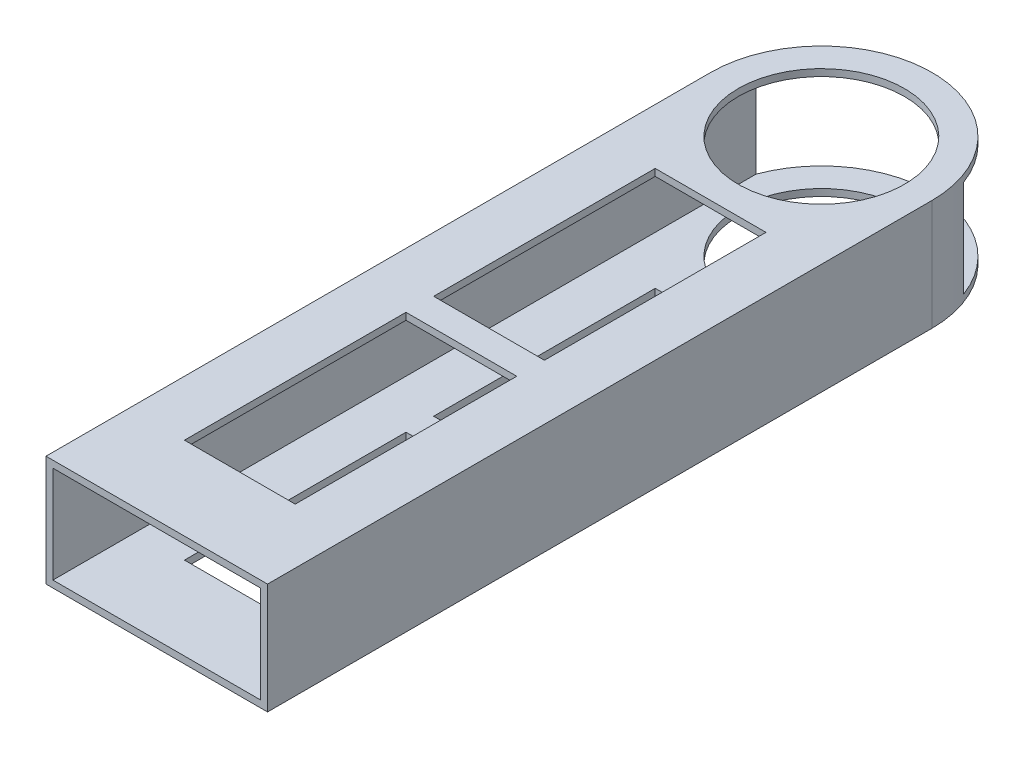
ISO-10303-21;
HEADER;
FILE_DESCRIPTION(('STEP AP214'),'2;1');
FILE_NAME('part.step','',(''),(''),'','','');
FILE_SCHEMA(('AUTOMOTIVE_DESIGN { 1 0 10303 214 1 1 1 1 }'));
ENDSEC;
DATA;
#1=APPLICATION_CONTEXT('core data for automotive mechanical design processes');
#2=APPLICATION_PROTOCOL_DEFINITION('international standard','automotive_design',2000,#1);
#3=PRODUCT_CONTEXT('',#1,'mechanical');
#4=PRODUCT('Part','Part','',(#3));
#5=PRODUCT_RELATED_PRODUCT_CATEGORY('part','',(#4));
#6=PRODUCT_DEFINITION_FORMATION('','',#4);
#7=PRODUCT_DEFINITION_CONTEXT('part definition',#1,'design');
#8=PRODUCT_DEFINITION('design','',#6,#7);
#9=PRODUCT_DEFINITION_SHAPE('','',#8);
#10=(LENGTH_UNIT() NAMED_UNIT(*) SI_UNIT(.MILLI.,.METRE.));
#11=(NAMED_UNIT(*) PLANE_ANGLE_UNIT() SI_UNIT($,.RADIAN.));
#12=(NAMED_UNIT(*) SI_UNIT($,.STERADIAN.) SOLID_ANGLE_UNIT());
#13=UNCERTAINTY_MEASURE_WITH_UNIT(LENGTH_MEASURE(1.E-05),#10,'distance_accuracy_value','');
#14=(GEOMETRIC_REPRESENTATION_CONTEXT(3) GLOBAL_UNCERTAINTY_ASSIGNED_CONTEXT((#13)) GLOBAL_UNIT_ASSIGNED_CONTEXT((#10,
#11,#12)) REPRESENTATION_CONTEXT('',''));
#15=CARTESIAN_POINT('',(0.,0.,0.));
#16=DIRECTION('',(0.,0.,1.));
#17=DIRECTION('',(1.,0.,0.));
#18=AXIS2_PLACEMENT_3D('',#15,#16,#17);
#19=CARTESIAN_POINT('',(25.4,-12.7,177.8));
#20=DIRECTION('',(0.,1.,0.));
#21=DIRECTION('',(-1.,0.,0.));
#22=AXIS2_PLACEMENT_3D('',#19,#20,#21);
#23=PLANE('',#22);
#24=CARTESIAN_POINT('',(0.,-12.7,25.4));
#25=DIRECTION('',(0.,1.,0.));
#26=DIRECTION('',(-1.,0.,0.));
#27=AXIS2_PLACEMENT_3D('',#24,#25,#26);
#28=CIRCLE('',#27,19.05);
#29=CARTESIAN_POINT('',(-19.05,-12.7,25.4));
#30=VERTEX_POINT('',#29);
#31=EDGE_CURVE('E378',#30,#30,#28,.F.);
#32=ORIENTED_EDGE('',*,*,#31,.F.);
#33=EDGE_LOOP('',(#32));
#34=FACE_BOUND('',#33,.T.);
#35=DIRECTION('',(1.,0.,0.));
#36=VECTOR('',#35,1.);
#37=CARTESIAN_POINT('',(0.,-12.7,101.6));
#38=LINE('',#37,#36);
#39=CARTESIAN_POINT('',(-12.7,-12.7,101.6));
#40=VERTEX_POINT('',#39);
#41=CARTESIAN_POINT('',(12.7,-12.7,101.6));
#42=VERTEX_POINT('',#41);
#43=EDGE_CURVE('E342',#40,#42,#38,.T.);
#44=ORIENTED_EDGE('',*,*,#43,.T.);
#45=DIRECTION('',(0.,0.,1.));
#46=VECTOR('',#45,1.);
#47=CARTESIAN_POINT('',(12.7,-12.7,0.));
#48=LINE('',#47,#46);
#49=CARTESIAN_POINT('',(12.7,-12.7,50.8));
#50=VERTEX_POINT('',#49);
#51=EDGE_CURVE('E339',#50,#42,#48,.T.);
#52=ORIENTED_EDGE('',*,*,#51,.F.);
#53=DIRECTION('',(1.,0.,0.));
#54=VECTOR('',#53,1.);
#55=CARTESIAN_POINT('',(0.,-12.7,50.8));
#56=LINE('',#55,#54);
#57=CARTESIAN_POINT('',(-12.7,-12.7,50.8));
#58=VERTEX_POINT('',#57);
#59=EDGE_CURVE('E341',#58,#50,#56,.T.);
#60=ORIENTED_EDGE('',*,*,#59,.F.);
#61=DIRECTION('',(0.,0.,1.));
#62=VECTOR('',#61,1.);
#63=CARTESIAN_POINT('',(-12.7,-12.7,0.));
#64=LINE('',#63,#62);
#65=EDGE_CURVE('E344',#58,#40,#64,.T.);
#66=ORIENTED_EDGE('',*,*,#65,.T.);
#67=EDGE_LOOP('',(#44,#52,#60,#66));
#68=FACE_BOUND('',#67,.T.);
#69=CARTESIAN_POINT('',(0.,-12.7,25.4));
#70=DIRECTION('',(0.,1.,0.));
#71=DIRECTION('',(-1.,0.,0.));
#72=AXIS2_PLACEMENT_3D('',#69,#70,#71);
#73=CIRCLE('',#72,25.4);
#74=CARTESIAN_POINT('',(25.4,-12.7,25.4));
#75=VERTEX_POINT('',#74);
#76=CARTESIAN_POINT('',(-25.4,-12.7,25.4));
#77=VERTEX_POINT('',#76);
#78=EDGE_CURVE('E400',#75,#77,#73,.T.);
#79=ORIENTED_EDGE('',*,*,#78,.F.);
#80=DIRECTION('',(0.,0.,-1.));
#81=VECTOR('',#80,1.);
#82=CARTESIAN_POINT('',(25.4,-12.7,177.8));
#83=LINE('',#82,#81);
#84=CARTESIAN_POINT('',(25.4,-12.7,177.8));
#85=VERTEX_POINT('',#84);
#86=EDGE_CURVE('E257',#85,#75,#83,.T.);
#87=ORIENTED_EDGE('',*,*,#86,.F.);
#88=DIRECTION('',(1.,0.,0.));
#89=VECTOR('',#88,1.);
#90=CARTESIAN_POINT('',(25.4,-12.7,177.8));
#91=LINE('',#90,#89);
#92=CARTESIAN_POINT('',(-25.4,-12.7,177.8));
#93=VERTEX_POINT('',#92);
#94=EDGE_CURVE('E430',#93,#85,#91,.T.);
#95=ORIENTED_EDGE('',*,*,#94,.F.);
#96=DIRECTION('',(0.,0.,-1.));
#97=VECTOR('',#96,1.);
#98=CARTESIAN_POINT('',(-25.4,-12.7,177.8));
#99=LINE('',#98,#97);
#100=EDGE_CURVE('E266',#93,#77,#99,.T.);
#101=ORIENTED_EDGE('',*,*,#100,.T.);
#102=EDGE_LOOP('',(#79,#87,#95,#101));
#103=FACE_BOUND('',#102,.T.);
#104=DIRECTION('',(1.,0.,0.));
#105=VECTOR('',#104,1.);
#106=CARTESIAN_POINT('',(0.,-12.7,158.75));
#107=LINE('',#106,#105);
#108=CARTESIAN_POINT('',(-12.7,-12.7,158.75));
#109=VERTEX_POINT('',#108);
#110=CARTESIAN_POINT('',(12.7,-12.7,158.75));
#111=VERTEX_POINT('',#110);
#112=EDGE_CURVE('E328',#109,#111,#107,.T.);
#113=ORIENTED_EDGE('',*,*,#112,.T.);
#114=DIRECTION('',(0.,0.,1.));
#115=VECTOR('',#114,1.);
#116=CARTESIAN_POINT('',(12.7,-12.7,0.));
#117=LINE('',#116,#115);
#118=CARTESIAN_POINT('',(12.7,-12.7,107.95));
#119=VERTEX_POINT('',#118);
#120=EDGE_CURVE('E338',#119,#111,#117,.T.);
#121=ORIENTED_EDGE('',*,*,#120,.F.);
#122=DIRECTION('',(1.,0.,0.));
#123=VECTOR('',#122,1.);
#124=CARTESIAN_POINT('',(0.,-12.7,107.95));
#125=LINE('',#124,#123);
#126=CARTESIAN_POINT('',(-12.7,-12.7,107.95));
#127=VERTEX_POINT('',#126);
#128=EDGE_CURVE('E459',#127,#119,#125,.T.);
#129=ORIENTED_EDGE('',*,*,#128,.F.);
#130=DIRECTION('',(0.,0.,1.));
#131=VECTOR('',#130,1.);
#132=CARTESIAN_POINT('',(-12.7,-12.7,0.));
#133=LINE('',#132,#131);
#134=EDGE_CURVE('E259',#127,#109,#133,.T.);
#135=ORIENTED_EDGE('',*,*,#134,.T.);
#136=EDGE_LOOP('',(#113,#121,#129,#135));
#137=FACE_BOUND('',#136,.T.);
#138=ADVANCED_FACE('F75',(#34,#68,#103,#137),#23,.F.);
#139=CARTESIAN_POINT('',(25.4,12.7,177.8));
#140=DIRECTION('',(0.,-1.,0.));
#141=DIRECTION('',(1.,0.,0.));
#142=AXIS2_PLACEMENT_3D('',#139,#140,#141);
#143=PLANE('',#142);
#144=CARTESIAN_POINT('',(0.,12.7,25.4));
#145=DIRECTION('',(0.,1.,0.));
#146=DIRECTION('',(-1.,0.,0.));
#147=AXIS2_PLACEMENT_3D('',#144,#145,#146);
#148=CIRCLE('',#147,19.05);
#149=CARTESIAN_POINT('',(-19.05,12.7,25.4));
#150=VERTEX_POINT('',#149);
#151=EDGE_CURVE('E258',#150,#150,#148,.T.);
#152=ORIENTED_EDGE('',*,*,#151,.F.);
#153=EDGE_LOOP('',(#152));
#154=FACE_BOUND('',#153,.T.);
#155=DIRECTION('',(-1.,0.,0.));
#156=VECTOR('',#155,1.);
#157=CARTESIAN_POINT('',(0.,12.7,101.6));
#158=LINE('',#157,#156);
#159=CARTESIAN_POINT('',(12.7,12.7,101.6));
#160=VERTEX_POINT('',#159);
#161=CARTESIAN_POINT('',(-12.7,12.7,101.6));
#162=VERTEX_POINT('',#161);
#163=EDGE_CURVE('E351',#160,#162,#158,.T.);
#164=ORIENTED_EDGE('',*,*,#163,.T.);
#165=DIRECTION('',(0.,0.,-1.));
#166=VECTOR('',#165,1.);
#167=CARTESIAN_POINT('',(-12.7,12.7,0.));
#168=LINE('',#167,#166);
#169=CARTESIAN_POINT('',(-12.7,12.7,50.8));
#170=VERTEX_POINT('',#169);
#171=EDGE_CURVE('E348',#162,#170,#168,.T.);
#172=ORIENTED_EDGE('',*,*,#171,.T.);
#173=DIRECTION('',(-1.,0.,0.));
#174=VECTOR('',#173,1.);
#175=CARTESIAN_POINT('',(0.,12.7,50.8));
#176=LINE('',#175,#174);
#177=CARTESIAN_POINT('',(12.7,12.7,50.8));
#178=VERTEX_POINT('',#177);
#179=EDGE_CURVE('E357',#178,#170,#176,.T.);
#180=ORIENTED_EDGE('',*,*,#179,.F.);
#181=DIRECTION('',(0.,0.,-1.));
#182=VECTOR('',#181,1.);
#183=CARTESIAN_POINT('',(12.7,12.7,0.));
#184=LINE('',#183,#182);
#185=EDGE_CURVE('E354',#160,#178,#184,.T.);
#186=ORIENTED_EDGE('',*,*,#185,.F.);
#187=EDGE_LOOP('',(#164,#172,#180,#186));
#188=FACE_BOUND('',#187,.T.);
#189=DIRECTION('',(0.,0.,-1.));
#190=VECTOR('',#189,1.);
#191=CARTESIAN_POINT('',(25.4,12.7,177.8));
#192=LINE('',#191,#190);
#193=CARTESIAN_POINT('',(25.4,12.7,177.8));
#194=VERTEX_POINT('',#193);
#195=CARTESIAN_POINT('',(25.4,12.7,25.4));
#196=VERTEX_POINT('',#195);
#197=EDGE_CURVE('E254',#194,#196,#192,.T.);
#198=ORIENTED_EDGE('',*,*,#197,.T.);
#199=CARTESIAN_POINT('',(0.,12.7,25.4));
#200=DIRECTION('',(0.,1.,0.));
#201=DIRECTION('',(-1.,0.,0.));
#202=AXIS2_PLACEMENT_3D('',#199,#200,#201);
#203=CIRCLE('',#202,25.4);
#204=CARTESIAN_POINT('',(-25.4,12.7,25.4));
#205=VERTEX_POINT('',#204);
#206=EDGE_CURVE('E237',#205,#196,#203,.F.);
#207=ORIENTED_EDGE('',*,*,#206,.F.);
#208=DIRECTION('',(0.,0.,-1.));
#209=VECTOR('',#208,1.);
#210=CARTESIAN_POINT('',(-25.4,12.7,177.8));
#211=LINE('',#210,#209);
#212=CARTESIAN_POINT('',(-25.4,12.7,177.8));
#213=VERTEX_POINT('',#212);
#214=EDGE_CURVE('E264',#213,#205,#211,.T.);
#215=ORIENTED_EDGE('',*,*,#214,.F.);
#216=DIRECTION('',(-1.,0.,0.));
#217=VECTOR('',#216,1.);
#218=CARTESIAN_POINT('',(25.4,12.7,177.8));
#219=LINE('',#218,#217);
#220=EDGE_CURVE('E263',#194,#213,#219,.T.);
#221=ORIENTED_EDGE('',*,*,#220,.F.);
#222=EDGE_LOOP('',(#198,#207,#215,#221));
#223=FACE_BOUND('',#222,.T.);
#224=DIRECTION('',(-1.,0.,0.));
#225=VECTOR('',#224,1.);
#226=CARTESIAN_POINT('',(0.,12.7,158.75));
#227=LINE('',#226,#225);
#228=CARTESIAN_POINT('',(12.7,12.7,158.75));
#229=VERTEX_POINT('',#228);
#230=CARTESIAN_POINT('',(-12.7,12.7,158.75));
#231=VERTEX_POINT('',#230);
#232=EDGE_CURVE('E308',#229,#231,#227,.T.);
#233=ORIENTED_EDGE('',*,*,#232,.T.);
#234=DIRECTION('',(0.,0.,-1.));
#235=VECTOR('',#234,1.);
#236=CARTESIAN_POINT('',(-12.7,12.7,0.));
#237=LINE('',#236,#235);
#238=CARTESIAN_POINT('',(-12.7,12.7,107.95));
#239=VERTEX_POINT('',#238);
#240=EDGE_CURVE('E347',#231,#239,#237,.T.);
#241=ORIENTED_EDGE('',*,*,#240,.T.);
#242=DIRECTION('',(-1.,0.,0.));
#243=VECTOR('',#242,1.);
#244=CARTESIAN_POINT('',(0.,12.7,107.95));
#245=LINE('',#244,#243);
#246=CARTESIAN_POINT('',(12.7,12.7,107.95));
#247=VERTEX_POINT('',#246);
#248=EDGE_CURVE('E324',#247,#239,#245,.T.);
#249=ORIENTED_EDGE('',*,*,#248,.F.);
#250=DIRECTION('',(0.,0.,-1.));
#251=VECTOR('',#250,1.);
#252=CARTESIAN_POINT('',(12.6999999999999,12.7,0.));
#253=LINE('',#252,#251);
#254=EDGE_CURVE('E466',#229,#247,#253,.T.);
#255=ORIENTED_EDGE('',*,*,#254,.F.);
#256=EDGE_LOOP('',(#233,#241,#249,#255));
#257=FACE_BOUND('',#256,.T.);
#258=ADVANCED_FACE('F261',(#154,#188,#223,#257),#143,.F.);
#259=CARTESIAN_POINT('',(23.8125,-11.1125,177.8));
#260=DIRECTION('',(0.,1.,0.));
#261=DIRECTION('',(-1.,0.,0.));
#262=AXIS2_PLACEMENT_3D('',#259,#260,#261);
#263=PLANE('',#262);
#264=DIRECTION('',(0.,0.,-1.));
#265=VECTOR('',#264,1.);
#266=CARTESIAN_POINT('',(23.8125,-11.1125,177.8));
#267=LINE('',#266,#265);
#268=CARTESIAN_POINT('',(23.8125,-11.1125,177.8));
#269=VERTEX_POINT('',#268);
#270=CARTESIAN_POINT('',(23.8125,-11.1125,16.5611740740073));
#271=VERTEX_POINT('',#270);
#272=EDGE_CURVE('E421',#269,#271,#267,.T.);
#273=ORIENTED_EDGE('',*,*,#272,.T.);
#274=CARTESIAN_POINT('',(0.,-11.1125,25.4));
#275=DIRECTION('',(0.,1.,0.));
#276=DIRECTION('',(-1.,0.,0.));
#277=AXIS2_PLACEMENT_3D('',#274,#275,#276);
#278=CIRCLE('',#277,25.4);
#279=CARTESIAN_POINT('',(-23.8125,-11.1125,16.5611740740074));
#280=VERTEX_POINT('',#279);
#281=EDGE_CURVE('E404',#280,#271,#278,.F.);
#282=ORIENTED_EDGE('',*,*,#281,.F.);
#283=DIRECTION('',(0.,0.,-1.));
#284=VECTOR('',#283,1.);
#285=CARTESIAN_POINT('',(-23.8125,-11.1125,177.8));
#286=LINE('',#285,#284);
#287=CARTESIAN_POINT('',(-23.8125,-11.1125,177.8));
#288=VERTEX_POINT('',#287);
#289=EDGE_CURVE('E424',#288,#280,#286,.T.);
#290=ORIENTED_EDGE('',*,*,#289,.F.);
#291=DIRECTION('',(1.,0.,0.));
#292=VECTOR('',#291,1.);
#293=CARTESIAN_POINT('',(23.8125,-11.1125,177.8));
#294=LINE('',#293,#292);
#295=EDGE_CURVE('E408',#288,#269,#294,.T.);
#296=ORIENTED_EDGE('',*,*,#295,.T.);
#297=EDGE_LOOP('',(#273,#282,#290,#296));
#298=FACE_BOUND('',#297,.T.);
#299=CARTESIAN_POINT('',(0.,-11.1125,25.4));
#300=DIRECTION('',(0.,1.,0.));
#301=DIRECTION('',(-1.,0.,0.));
#302=AXIS2_PLACEMENT_3D('',#299,#300,#301);
#303=CIRCLE('',#302,19.05);
#304=CARTESIAN_POINT('',(-19.05,-11.1125,25.4));
#305=VERTEX_POINT('',#304);
#306=EDGE_CURVE('E248',#305,#305,#303,.T.);
#307=ORIENTED_EDGE('',*,*,#306,.F.);
#308=EDGE_LOOP('',(#307));
#309=FACE_BOUND('',#308,.T.);
#310=DIRECTION('',(0.,0.,-1.));
#311=VECTOR('',#310,1.);
#312=CARTESIAN_POINT('',(12.7,-11.1125,177.8));
#313=LINE('',#312,#311);
#314=CARTESIAN_POINT('',(12.7,-11.1125,101.6));
#315=VERTEX_POINT('',#314);
#316=CARTESIAN_POINT('',(12.7,-11.1125,50.8));
#317=VERTEX_POINT('',#316);
#318=EDGE_CURVE('E381',#315,#317,#313,.T.);
#319=ORIENTED_EDGE('',*,*,#318,.F.);
#320=DIRECTION('',(-1.,0.,0.));
#321=VECTOR('',#320,1.);
#322=CARTESIAN_POINT('',(23.8125,-11.1125,101.6));
#323=LINE('',#322,#321);
#324=CARTESIAN_POINT('',(-12.7,-11.1125,101.6));
#325=VERTEX_POINT('',#324);
#326=EDGE_CURVE('E383',#315,#325,#323,.T.);
#327=ORIENTED_EDGE('',*,*,#326,.T.);
#328=DIRECTION('',(0.,0.,-1.));
#329=VECTOR('',#328,1.);
#330=CARTESIAN_POINT('',(-12.7,-11.1125,177.8));
#331=LINE('',#330,#329);
#332=CARTESIAN_POINT('',(-12.7,-11.1125,50.8));
#333=VERTEX_POINT('',#332);
#334=EDGE_CURVE('E374',#325,#333,#331,.T.);
#335=ORIENTED_EDGE('',*,*,#334,.T.);
#336=DIRECTION('',(-1.,0.,0.));
#337=VECTOR('',#336,1.);
#338=CARTESIAN_POINT('',(23.8125,-11.1125,50.8));
#339=LINE('',#338,#337);
#340=EDGE_CURVE('E377',#317,#333,#339,.T.);
#341=ORIENTED_EDGE('',*,*,#340,.F.);
#342=EDGE_LOOP('',(#319,#327,#335,#341));
#343=FACE_BOUND('',#342,.T.);
#344=DIRECTION('',(0.,0.,-1.));
#345=VECTOR('',#344,1.);
#346=CARTESIAN_POINT('',(12.7000000000001,-11.1125,177.8));
#347=LINE('',#346,#345);
#348=CARTESIAN_POINT('',(12.7,-11.1125,158.75));
#349=VERTEX_POINT('',#348);
#350=CARTESIAN_POINT('',(12.7,-11.1125,107.95));
#351=VERTEX_POINT('',#350);
#352=EDGE_CURVE('E392',#349,#351,#347,.T.);
#353=ORIENTED_EDGE('',*,*,#352,.F.);
#354=DIRECTION('',(-1.,0.,0.));
#355=VECTOR('',#354,1.);
#356=CARTESIAN_POINT('',(23.8125,-11.1125,158.75));
#357=LINE('',#356,#355);
#358=CARTESIAN_POINT('',(-12.7,-11.1125,158.75));
#359=VERTEX_POINT('',#358);
#360=EDGE_CURVE('E394',#349,#359,#357,.T.);
#361=ORIENTED_EDGE('',*,*,#360,.T.);
#362=DIRECTION('',(0.,0.,-1.));
#363=VECTOR('',#362,1.);
#364=CARTESIAN_POINT('',(-12.7,-11.1125,177.8));
#365=LINE('',#364,#363);
#366=CARTESIAN_POINT('',(-12.7,-11.1125,107.95));
#367=VERTEX_POINT('',#366);
#368=EDGE_CURVE('E386',#359,#367,#365,.T.);
#369=ORIENTED_EDGE('',*,*,#368,.T.);
#370=DIRECTION('',(-1.,0.,0.));
#371=VECTOR('',#370,1.);
#372=CARTESIAN_POINT('',(23.8125,-11.1125,107.95));
#373=LINE('',#372,#371);
#374=EDGE_CURVE('E389',#351,#367,#373,.T.);
#375=ORIENTED_EDGE('',*,*,#374,.F.);
#376=EDGE_LOOP('',(#353,#361,#369,#375));
#377=FACE_BOUND('',#376,.T.);
#378=ADVANCED_FACE('F455',(#298,#309,#343,#377),#263,.T.);
#379=CARTESIAN_POINT('',(23.8125,11.1125,177.8));
#380=DIRECTION('',(0.,-1.,0.));
#381=DIRECTION('',(1.,0.,0.));
#382=AXIS2_PLACEMENT_3D('',#379,#380,#381);
#383=PLANE('',#382);
#384=CARTESIAN_POINT('',(0.,11.1125,25.4));
#385=DIRECTION('',(0.,-1.,0.));
#386=DIRECTION('',(1.,0.,0.));
#387=AXIS2_PLACEMENT_3D('',#384,#385,#386);
#388=CIRCLE('',#387,25.4);
#389=CARTESIAN_POINT('',(23.8125,11.1125,16.5611740740073));
#390=VERTEX_POINT('',#389);
#391=CARTESIAN_POINT('',(-23.8125,11.1125,16.5611740740073));
#392=VERTEX_POINT('',#391);
#393=EDGE_CURVE('E273',#390,#392,#388,.F.);
#394=ORIENTED_EDGE('',*,*,#393,.F.);
#395=DIRECTION('',(0.,0.,-1.));
#396=VECTOR('',#395,1.);
#397=CARTESIAN_POINT('',(23.8125,11.1125,177.8));
#398=LINE('',#397,#396);
#399=CARTESIAN_POINT('',(23.8125,11.1125,177.8));
#400=VERTEX_POINT('',#399);
#401=EDGE_CURVE('E418',#400,#390,#398,.T.);
#402=ORIENTED_EDGE('',*,*,#401,.F.);
#403=DIRECTION('',(-1.,0.,0.));
#404=VECTOR('',#403,1.);
#405=CARTESIAN_POINT('',(23.8125,11.1125,177.8));
#406=LINE('',#405,#404);
#407=CARTESIAN_POINT('',(-23.8125,11.1125,177.8));
#408=VERTEX_POINT('',#407);
#409=EDGE_CURVE('E413',#400,#408,#406,.T.);
#410=ORIENTED_EDGE('',*,*,#409,.T.);
#411=DIRECTION('',(0.,0.,-1.));
#412=VECTOR('',#411,1.);
#413=CARTESIAN_POINT('',(-23.8125,11.1125,177.8));
#414=LINE('',#413,#412);
#415=EDGE_CURVE('E415',#408,#392,#414,.T.);
#416=ORIENTED_EDGE('',*,*,#415,.T.);
#417=EDGE_LOOP('',(#394,#402,#410,#416));
#418=FACE_BOUND('',#417,.T.);
#419=CARTESIAN_POINT('',(0.,11.1125,25.4));
#420=DIRECTION('',(0.,-1.,0.));
#421=DIRECTION('',(1.,0.,0.));
#422=AXIS2_PLACEMENT_3D('',#419,#420,#421);
#423=CIRCLE('',#422,19.05);
#424=CARTESIAN_POINT('',(19.05,11.1125,25.4));
#425=VERTEX_POINT('',#424);
#426=EDGE_CURVE('E79',#425,#425,#423,.T.);
#427=ORIENTED_EDGE('',*,*,#426,.F.);
#428=EDGE_LOOP('',(#427));
#429=FACE_BOUND('',#428,.T.);
#430=DIRECTION('',(0.,0.,1.));
#431=VECTOR('',#430,1.);
#432=CARTESIAN_POINT('',(-12.7,11.1125,177.8));
#433=LINE('',#432,#431);
#434=CARTESIAN_POINT('',(-12.7,11.1125,50.8));
#435=VERTEX_POINT('',#434);
#436=CARTESIAN_POINT('',(-12.7,11.1125,101.6));
#437=VERTEX_POINT('',#436);
#438=EDGE_CURVE('E278',#435,#437,#433,.T.);
#439=ORIENTED_EDGE('',*,*,#438,.T.);
#440=DIRECTION('',(1.,0.,0.));
#441=VECTOR('',#440,1.);
#442=CARTESIAN_POINT('',(23.8125,11.1125,101.6));
#443=LINE('',#442,#441);
#444=CARTESIAN_POINT('',(12.7,11.1125,101.6));
#445=VERTEX_POINT('',#444);
#446=EDGE_CURVE('E285',#437,#445,#443,.T.);
#447=ORIENTED_EDGE('',*,*,#446,.T.);
#448=DIRECTION('',(0.,0.,1.));
#449=VECTOR('',#448,1.);
#450=CARTESIAN_POINT('',(12.7,11.1125,177.8));
#451=LINE('',#450,#449);
#452=CARTESIAN_POINT('',(12.7,11.1125,50.8));
#453=VERTEX_POINT('',#452);
#454=EDGE_CURVE('E283',#453,#445,#451,.T.);
#455=ORIENTED_EDGE('',*,*,#454,.F.);
#456=DIRECTION('',(1.,0.,0.));
#457=VECTOR('',#456,1.);
#458=CARTESIAN_POINT('',(23.8125,11.1125,50.8));
#459=LINE('',#458,#457);
#460=EDGE_CURVE('E281',#435,#453,#459,.T.);
#461=ORIENTED_EDGE('',*,*,#460,.F.);
#462=EDGE_LOOP('',(#439,#447,#455,#461));
#463=FACE_BOUND('',#462,.T.);
#464=DIRECTION('',(0.,0.,1.));
#465=VECTOR('',#464,1.);
#466=CARTESIAN_POINT('',(-12.7,11.1125,177.8));
#467=LINE('',#466,#465);
#468=CARTESIAN_POINT('',(-12.7,11.1125,107.95));
#469=VERTEX_POINT('',#468);
#470=CARTESIAN_POINT('',(-12.7,11.1125,158.75));
#471=VERTEX_POINT('',#470);
#472=EDGE_CURVE('E288',#469,#471,#467,.T.);
#473=ORIENTED_EDGE('',*,*,#472,.T.);
#474=DIRECTION('',(1.,0.,0.));
#475=VECTOR('',#474,1.);
#476=CARTESIAN_POINT('',(23.8125,11.1125,158.75));
#477=LINE('',#476,#475);
#478=CARTESIAN_POINT('',(12.7,11.1125,158.75));
#479=VERTEX_POINT('',#478);
#480=EDGE_CURVE('E12',#471,#479,#477,.T.);
#481=ORIENTED_EDGE('',*,*,#480,.T.);
#482=DIRECTION('',(0.,0.,1.));
#483=VECTOR('',#482,1.);
#484=CARTESIAN_POINT('',(12.7,11.1125,177.8));
#485=LINE('',#484,#483);
#486=CARTESIAN_POINT('',(12.7,11.1125,107.95));
#487=VERTEX_POINT('',#486);
#488=EDGE_CURVE('E84',#487,#479,#485,.T.);
#489=ORIENTED_EDGE('',*,*,#488,.F.);
#490=DIRECTION('',(1.,0.,0.));
#491=VECTOR('',#490,1.);
#492=CARTESIAN_POINT('',(23.8125,11.1125,107.95));
#493=LINE('',#492,#491);
#494=EDGE_CURVE('E291',#469,#487,#493,.T.);
#495=ORIENTED_EDGE('',*,*,#494,.F.);
#496=EDGE_LOOP('',(#473,#481,#489,#495));
#497=FACE_BOUND('',#496,.T.);
#498=ADVANCED_FACE('F312',(#418,#429,#463,#497),#383,.T.);
#499=CARTESIAN_POINT('',(25.4,-12.7,177.8));
#500=DIRECTION('',(-1.,0.,0.));
#501=DIRECTION('',(0.,-1.,0.));
#502=AXIS2_PLACEMENT_3D('',#499,#500,#501);
#503=PLANE('',#502);
#504=DIRECTION('',(0.,1.,0.));
#505=VECTOR('',#504,1.);
#506=CARTESIAN_POINT('',(25.4,-69.4961266284947,25.4));
#507=LINE('',#506,#505);
#508=EDGE_CURVE('E240',#75,#196,#507,.T.);
#509=ORIENTED_EDGE('',*,*,#508,.T.);
#510=ORIENTED_EDGE('',*,*,#197,.F.);
#511=DIRECTION('',(0.,1.,0.));
#512=VECTOR('',#511,1.);
#513=CARTESIAN_POINT('',(25.4,-12.7,177.8));
#514=LINE('',#513,#512);
#515=EDGE_CURVE('E432',#85,#194,#514,.T.);
#516=ORIENTED_EDGE('',*,*,#515,.F.);
#517=ORIENTED_EDGE('',*,*,#86,.T.);
#518=EDGE_LOOP('',(#509,#510,#516,#517));
#519=FACE_BOUND('',#518,.T.);
#520=ADVANCED_FACE('F252',(#519),#503,.F.);
#521=CARTESIAN_POINT('',(0.,0.,177.8));
#522=DIRECTION('',(0.,0.,1.));
#523=DIRECTION('',(1.,0.,0.));
#524=AXIS2_PLACEMENT_3D('',#521,#522,#523);
#525=PLANE('',#524);
#526=DIRECTION('',(0.,-1.,0.));
#527=VECTOR('',#526,1.);
#528=CARTESIAN_POINT('',(-25.4,-12.7,177.8));
#529=LINE('',#528,#527);
#530=EDGE_CURVE('E427',#213,#93,#529,.T.);
#531=ORIENTED_EDGE('',*,*,#530,.T.);
#532=ORIENTED_EDGE('',*,*,#94,.T.);
#533=ORIENTED_EDGE('',*,*,#515,.T.);
#534=ORIENTED_EDGE('',*,*,#220,.T.);
#535=EDGE_LOOP('',(#531,#532,#533,#534));
#536=FACE_BOUND('',#535,.T.);
#537=ORIENTED_EDGE('',*,*,#295,.F.);
#538=DIRECTION('',(0.,-1.,0.));
#539=VECTOR('',#538,1.);
#540=CARTESIAN_POINT('',(-23.8125,-11.1125,177.8));
#541=LINE('',#540,#539);
#542=EDGE_CURVE('E406',#408,#288,#541,.T.);
#543=ORIENTED_EDGE('',*,*,#542,.F.);
#544=ORIENTED_EDGE('',*,*,#409,.F.);
#545=DIRECTION('',(0.,1.,0.));
#546=VECTOR('',#545,1.);
#547=CARTESIAN_POINT('',(23.8125,-11.1125,177.8));
#548=LINE('',#547,#546);
#549=EDGE_CURVE('E410',#269,#400,#548,.T.);
#550=ORIENTED_EDGE('',*,*,#549,.F.);
#551=EDGE_LOOP('',(#537,#543,#544,#550));
#552=FACE_BOUND('',#551,.T.);
#553=ADVANCED_FACE('F434',(#536,#552),#525,.T.);
#554=CARTESIAN_POINT('',(-25.4,-12.7,177.8));
#555=DIRECTION('',(1.,0.,0.));
#556=DIRECTION('',(0.,0.,-1.));
#557=AXIS2_PLACEMENT_3D('',#554,#555,#556);
#558=PLANE('',#557);
#559=ORIENTED_EDGE('',*,*,#214,.T.);
#560=DIRECTION('',(0.,1.,0.));
#561=VECTOR('',#560,1.);
#562=CARTESIAN_POINT('',(-25.4,-69.4961266284947,25.4));
#563=LINE('',#562,#561);
#564=EDGE_CURVE('E243',#77,#205,#563,.T.);
#565=ORIENTED_EDGE('',*,*,#564,.F.);
#566=ORIENTED_EDGE('',*,*,#100,.F.);
#567=ORIENTED_EDGE('',*,*,#530,.F.);
#568=EDGE_LOOP('',(#559,#565,#566,#567));
#569=FACE_BOUND('',#568,.T.);
#570=ADVANCED_FACE('F77',(#569),#558,.F.);
#571=CARTESIAN_POINT('',(-23.8125,-11.1125,177.8));
#572=DIRECTION('',(1.,0.,0.));
#573=DIRECTION('',(0.,0.,-1.));
#574=AXIS2_PLACEMENT_3D('',#571,#572,#573);
#575=PLANE('',#574);
#576=DIRECTION('',(0.,1.,0.));
#577=VECTOR('',#576,1.);
#578=CARTESIAN_POINT('',(-23.8125,-69.4961266284947,16.5611740740074));
#579=LINE('',#578,#577);
#580=EDGE_CURVE('E402',#392,#280,#579,.F.);
#581=ORIENTED_EDGE('',*,*,#580,.F.);
#582=ORIENTED_EDGE('',*,*,#415,.F.);
#583=ORIENTED_EDGE('',*,*,#542,.T.);
#584=ORIENTED_EDGE('',*,*,#289,.T.);
#585=EDGE_LOOP('',(#581,#582,#583,#584));
#586=FACE_BOUND('',#585,.T.);
#587=ADVANCED_FACE('F495',(#586),#575,.T.);
#588=CARTESIAN_POINT('',(23.8125,-11.1125,177.8));
#589=DIRECTION('',(-1.,0.,0.));
#590=DIRECTION('',(0.,0.,1.));
#591=AXIS2_PLACEMENT_3D('',#588,#589,#590);
#592=PLANE('',#591);
#593=DIRECTION('',(0.,1.,0.));
#594=VECTOR('',#593,1.);
#595=CARTESIAN_POINT('',(23.8125,-69.4961266284947,16.5611740740073));
#596=LINE('',#595,#594);
#597=EDGE_CURVE('E275',#271,#390,#596,.T.);
#598=ORIENTED_EDGE('',*,*,#597,.F.);
#599=ORIENTED_EDGE('',*,*,#272,.F.);
#600=ORIENTED_EDGE('',*,*,#549,.T.);
#601=ORIENTED_EDGE('',*,*,#401,.T.);
#602=EDGE_LOOP('',(#598,#599,#600,#601));
#603=FACE_BOUND('',#602,.T.);
#604=ADVANCED_FACE('F493',(#603),#592,.T.);
#605=CARTESIAN_POINT('',(0.,-69.4961266284947,25.4));
#606=DIRECTION('',(0.,1.,0.));
#607=DIRECTION('',(-1.,0.,0.));
#608=AXIS2_PLACEMENT_3D('',#605,#606,#607);
#609=CYLINDRICAL_SURFACE('',#608,25.4);
#610=ORIENTED_EDGE('',*,*,#281,.T.);
#611=ORIENTED_EDGE('',*,*,#597,.T.);
#612=ORIENTED_EDGE('',*,*,#393,.T.);
#613=ORIENTED_EDGE('',*,*,#580,.T.);
#614=EDGE_LOOP('',(#610,#611,#612,#613));
#615=FACE_BOUND('',#614,.T.);
#616=ORIENTED_EDGE('',*,*,#508,.F.);
#617=ORIENTED_EDGE('',*,*,#78,.T.);
#618=ORIENTED_EDGE('',*,*,#564,.T.);
#619=ORIENTED_EDGE('',*,*,#206,.T.);
#620=EDGE_LOOP('',(#616,#617,#618,#619));
#621=FACE_BOUND('',#620,.T.);
#622=ADVANCED_FACE('F239',(#615,#621),#609,.T.);
#623=CARTESIAN_POINT('',(-12.7,-69.4961266284947,0.));
#624=DIRECTION('',(1.,0.,0.));
#625=DIRECTION('',(0.,1.,0.));
#626=AXIS2_PLACEMENT_3D('',#623,#624,#625);
#627=PLANE('',#626);
#628=DIRECTION('',(0.,1.,0.));
#629=VECTOR('',#628,1.);
#630=CARTESIAN_POINT('',(-12.7,-69.4961266284947,50.8));
#631=LINE('',#630,#629);
#632=EDGE_CURVE('E362',#435,#170,#631,.T.);
#633=ORIENTED_EDGE('',*,*,#632,.T.);
#634=ORIENTED_EDGE('',*,*,#171,.F.);
#635=DIRECTION('',(0.,1.,0.));
#636=VECTOR('',#635,1.);
#637=CARTESIAN_POINT('',(-12.7,-69.4961266284947,101.6));
#638=LINE('',#637,#636);
#639=EDGE_CURVE('E359',#437,#162,#638,.T.);
#640=ORIENTED_EDGE('',*,*,#639,.F.);
#641=ORIENTED_EDGE('',*,*,#438,.F.);
#642=EDGE_LOOP('',(#633,#634,#640,#641));
#643=FACE_BOUND('',#642,.T.);
#644=ADVANCED_FACE('F515',(#643),#627,.T.);
#645=CARTESIAN_POINT('',(0.,-69.4961266284947,50.8));
#646=DIRECTION('',(0.,0.,-1.));
#647=DIRECTION('',(-1.,0.,0.));
#648=AXIS2_PLACEMENT_3D('',#645,#646,#647);
#649=PLANE('',#648);
#650=ORIENTED_EDGE('',*,*,#460,.T.);
#651=DIRECTION('',(0.,1.,0.));
#652=VECTOR('',#651,1.);
#653=CARTESIAN_POINT('',(12.7,-69.4961266284947,50.8));
#654=LINE('',#653,#652);
#655=EDGE_CURVE('E366',#453,#178,#654,.T.);
#656=ORIENTED_EDGE('',*,*,#655,.T.);
#657=ORIENTED_EDGE('',*,*,#179,.T.);
#658=ORIENTED_EDGE('',*,*,#632,.F.);
#659=EDGE_LOOP('',(#650,#656,#657,#658));
#660=FACE_BOUND('',#659,.T.);
#661=ADVANCED_FACE('F519',(#660),#649,.F.);
#662=CARTESIAN_POINT('',(12.7,-69.4961266284947,0.));
#663=DIRECTION('',(1.,0.,0.));
#664=DIRECTION('',(0.,0.,-1.));
#665=AXIS2_PLACEMENT_3D('',#662,#663,#664);
#666=PLANE('',#665);
#667=ORIENTED_EDGE('',*,*,#454,.T.);
#668=DIRECTION('',(0.,1.,0.));
#669=VECTOR('',#668,1.);
#670=CARTESIAN_POINT('',(12.7,-69.4961266284947,101.6));
#671=LINE('',#670,#669);
#672=EDGE_CURVE('E370',#445,#160,#671,.T.);
#673=ORIENTED_EDGE('',*,*,#672,.T.);
#674=ORIENTED_EDGE('',*,*,#185,.T.);
#675=ORIENTED_EDGE('',*,*,#655,.F.);
#676=EDGE_LOOP('',(#667,#673,#674,#675));
#677=FACE_BOUND('',#676,.T.);
#678=ADVANCED_FACE('F525',(#677),#666,.F.);
#679=CARTESIAN_POINT('',(0.,-69.4961266284947,101.6));
#680=DIRECTION('',(0.,0.,-1.));
#681=DIRECTION('',(-1.,0.,0.));
#682=AXIS2_PLACEMENT_3D('',#679,#680,#681);
#683=PLANE('',#682);
#684=ORIENTED_EDGE('',*,*,#639,.T.);
#685=ORIENTED_EDGE('',*,*,#163,.F.);
#686=ORIENTED_EDGE('',*,*,#672,.F.);
#687=ORIENTED_EDGE('',*,*,#446,.F.);
#688=EDGE_LOOP('',(#684,#685,#686,#687));
#689=FACE_BOUND('',#688,.T.);
#690=ADVANCED_FACE('F547',(#689),#683,.T.);
#691=CARTESIAN_POINT('',(-12.7,-69.4961266284947,0.));
#692=DIRECTION('',(1.,0.,0.));
#693=DIRECTION('',(0.,1.,0.));
#694=AXIS2_PLACEMENT_3D('',#691,#692,#693);
#695=PLANE('',#694);
#696=DIRECTION('',(0.,1.,0.));
#697=VECTOR('',#696,1.);
#698=CARTESIAN_POINT('',(-12.7,-69.4961266284947,107.95));
#699=LINE('',#698,#697);
#700=EDGE_CURVE('E318',#469,#239,#699,.T.);
#701=ORIENTED_EDGE('',*,*,#700,.T.);
#702=ORIENTED_EDGE('',*,*,#240,.F.);
#703=DIRECTION('',(0.,1.,0.));
#704=VECTOR('',#703,1.);
#705=CARTESIAN_POINT('',(-12.7,-69.4961266284947,158.75));
#706=LINE('',#705,#704);
#707=EDGE_CURVE('E320',#471,#231,#706,.T.);
#708=ORIENTED_EDGE('',*,*,#707,.F.);
#709=ORIENTED_EDGE('',*,*,#472,.F.);
#710=EDGE_LOOP('',(#701,#702,#708,#709));
#711=FACE_BOUND('',#710,.T.);
#712=ADVANCED_FACE('F316',(#711),#695,.T.);
#713=CARTESIAN_POINT('',(0.,-69.4961266284947,107.95));
#714=DIRECTION('',(0.,0.,-1.));
#715=DIRECTION('',(-1.,0.,0.));
#716=AXIS2_PLACEMENT_3D('',#713,#714,#715);
#717=PLANE('',#716);
#718=ORIENTED_EDGE('',*,*,#494,.T.);
#719=DIRECTION('',(0.,1.,0.));
#720=VECTOR('',#719,1.);
#721=CARTESIAN_POINT('',(12.7,-69.4961266284947,107.95));
#722=LINE('',#721,#720);
#723=EDGE_CURVE('E301',#487,#247,#722,.T.);
#724=ORIENTED_EDGE('',*,*,#723,.T.);
#725=ORIENTED_EDGE('',*,*,#248,.T.);
#726=ORIENTED_EDGE('',*,*,#700,.F.);
#727=EDGE_LOOP('',(#718,#724,#725,#726));
#728=FACE_BOUND('',#727,.T.);
#729=ADVANCED_FACE('F322',(#728),#717,.F.);
#730=CARTESIAN_POINT('',(12.7,-69.4961266284947,0.));
#731=DIRECTION('',(1.,0.,0.));
#732=DIRECTION('',(0.,0.,-1.));
#733=AXIS2_PLACEMENT_3D('',#730,#731,#732);
#734=PLANE('',#733);
#735=ORIENTED_EDGE('',*,*,#488,.T.);
#736=DIRECTION('',(0.,1.,0.));
#737=VECTOR('',#736,1.);
#738=CARTESIAN_POINT('',(12.7,-69.4961266284947,158.75));
#739=LINE('',#738,#737);
#740=EDGE_CURVE('E299',#479,#229,#739,.T.);
#741=ORIENTED_EDGE('',*,*,#740,.T.);
#742=ORIENTED_EDGE('',*,*,#254,.T.);
#743=ORIENTED_EDGE('',*,*,#723,.F.);
#744=EDGE_LOOP('',(#735,#741,#742,#743));
#745=FACE_BOUND('',#744,.T.);
#746=ADVANCED_FACE('F297',(#745),#734,.F.);
#747=CARTESIAN_POINT('',(0.,-69.4961266284947,158.75));
#748=DIRECTION('',(0.,0.,-1.));
#749=DIRECTION('',(-1.,0.,0.));
#750=AXIS2_PLACEMENT_3D('',#747,#748,#749);
#751=PLANE('',#750);
#752=ORIENTED_EDGE('',*,*,#707,.T.);
#753=ORIENTED_EDGE('',*,*,#232,.F.);
#754=ORIENTED_EDGE('',*,*,#740,.F.);
#755=ORIENTED_EDGE('',*,*,#480,.F.);
#756=EDGE_LOOP('',(#752,#753,#754,#755));
#757=FACE_BOUND('',#756,.T.);
#758=ADVANCED_FACE('F306',(#757),#751,.T.);
#759=CARTESIAN_POINT('',(0.,-69.4961266284947,25.4));
#760=DIRECTION('',(0.,1.,0.));
#761=DIRECTION('',(-1.,0.,0.));
#762=AXIS2_PLACEMENT_3D('',#759,#760,#761);
#763=CYLINDRICAL_SURFACE('',#762,19.05);
#764=ORIENTED_EDGE('',*,*,#426,.T.);
#765=EDGE_LOOP('',(#764));
#766=FACE_BOUND('',#765,.T.);
#767=ORIENTED_EDGE('',*,*,#151,.T.);
#768=EDGE_LOOP('',(#767));
#769=FACE_BOUND('',#768,.T.);
#770=ADVANCED_FACE('F556',(#766,#769),#763,.F.);
#771=EDGE_CURVE('E367',#42,#315,#671,.T.);
#772=ORIENTED_EDGE('',*,*,#771,.F.);
#773=ORIENTED_EDGE('',*,*,#43,.F.);
#774=EDGE_CURVE('E99',#40,#325,#638,.T.);
#775=ORIENTED_EDGE('',*,*,#774,.T.);
#776=ORIENTED_EDGE('',*,*,#326,.F.);
#777=EDGE_LOOP('',(#772,#773,#775,#776));
#778=FACE_BOUND('',#777,.T.);
#779=ADVANCED_FACE('F542',(#778),#683,.T.);
#780=ORIENTED_EDGE('',*,*,#318,.T.);
#781=EDGE_CURVE('E363',#50,#317,#654,.T.);
#782=ORIENTED_EDGE('',*,*,#781,.F.);
#783=ORIENTED_EDGE('',*,*,#51,.T.);
#784=ORIENTED_EDGE('',*,*,#771,.T.);
#785=EDGE_LOOP('',(#780,#782,#783,#784));
#786=FACE_BOUND('',#785,.T.);
#787=ADVANCED_FACE('F537',(#786),#666,.F.);
#788=ORIENTED_EDGE('',*,*,#340,.T.);
#789=EDGE_CURVE('E360',#58,#333,#631,.T.);
#790=ORIENTED_EDGE('',*,*,#789,.F.);
#791=ORIENTED_EDGE('',*,*,#59,.T.);
#792=ORIENTED_EDGE('',*,*,#781,.T.);
#793=EDGE_LOOP('',(#788,#790,#791,#792));
#794=FACE_BOUND('',#793,.T.);
#795=ADVANCED_FACE('F528',(#794),#649,.F.);
#796=ORIENTED_EDGE('',*,*,#774,.F.);
#797=ORIENTED_EDGE('',*,*,#65,.F.);
#798=ORIENTED_EDGE('',*,*,#789,.T.);
#799=ORIENTED_EDGE('',*,*,#334,.F.);
#800=EDGE_LOOP('',(#796,#797,#798,#799));
#801=FACE_BOUND('',#800,.T.);
#802=ADVANCED_FACE('F521',(#801),#627,.T.);
#803=EDGE_CURVE('E310',#111,#349,#739,.T.);
#804=ORIENTED_EDGE('',*,*,#803,.F.);
#805=ORIENTED_EDGE('',*,*,#112,.F.);
#806=EDGE_CURVE('E91',#109,#359,#706,.T.);
#807=ORIENTED_EDGE('',*,*,#806,.T.);
#808=ORIENTED_EDGE('',*,*,#360,.F.);
#809=EDGE_LOOP('',(#804,#805,#807,#808));
#810=FACE_BOUND('',#809,.T.);
#811=ADVANCED_FACE('F448',(#810),#751,.T.);
#812=ORIENTED_EDGE('',*,*,#352,.T.);
#813=EDGE_CURVE('E326',#119,#351,#722,.T.);
#814=ORIENTED_EDGE('',*,*,#813,.F.);
#815=ORIENTED_EDGE('',*,*,#120,.T.);
#816=ORIENTED_EDGE('',*,*,#803,.T.);
#817=EDGE_LOOP('',(#812,#814,#815,#816));
#818=FACE_BOUND('',#817,.T.);
#819=ADVANCED_FACE('F451',(#818),#734,.F.);
#820=ORIENTED_EDGE('',*,*,#374,.T.);
#821=EDGE_CURVE('E325',#127,#367,#699,.T.);
#822=ORIENTED_EDGE('',*,*,#821,.F.);
#823=ORIENTED_EDGE('',*,*,#128,.T.);
#824=ORIENTED_EDGE('',*,*,#813,.T.);
#825=EDGE_LOOP('',(#820,#822,#823,#824));
#826=FACE_BOUND('',#825,.T.);
#827=ADVANCED_FACE('F458',(#826),#717,.F.);
#828=ORIENTED_EDGE('',*,*,#806,.F.);
#829=ORIENTED_EDGE('',*,*,#134,.F.);
#830=ORIENTED_EDGE('',*,*,#821,.T.);
#831=ORIENTED_EDGE('',*,*,#368,.F.);
#832=EDGE_LOOP('',(#828,#829,#830,#831));
#833=FACE_BOUND('',#832,.T.);
#834=ADVANCED_FACE('F554',(#833),#695,.T.);
#835=ORIENTED_EDGE('',*,*,#306,.T.);
#836=EDGE_LOOP('',(#835));
#837=FACE_BOUND('',#836,.T.);
#838=ORIENTED_EDGE('',*,*,#31,.T.);
#839=EDGE_LOOP('',(#838));
#840=FACE_BOUND('',#839,.T.);
#841=ADVANCED_FACE('F563',(#837,#840),#763,.F.);
#842=CLOSED_SHELL('',(#138,#258,#378,#498,#520,#553,#570,#587,#604,#622,#644,#661,#678,#690,
#712,#729,#746,#758,#770,#779,#787,#795,#802,#811,#819,#827,#834,#841));
#843=MANIFOLD_SOLID_BREP('B2',#842);
#844=ADVANCED_BREP_SHAPE_REPRESENTATION('',(#18,#843),#14);
#845=SHAPE_DEFINITION_REPRESENTATION(#9,#844);
ENDSEC;
END-ISO-10303-21;
